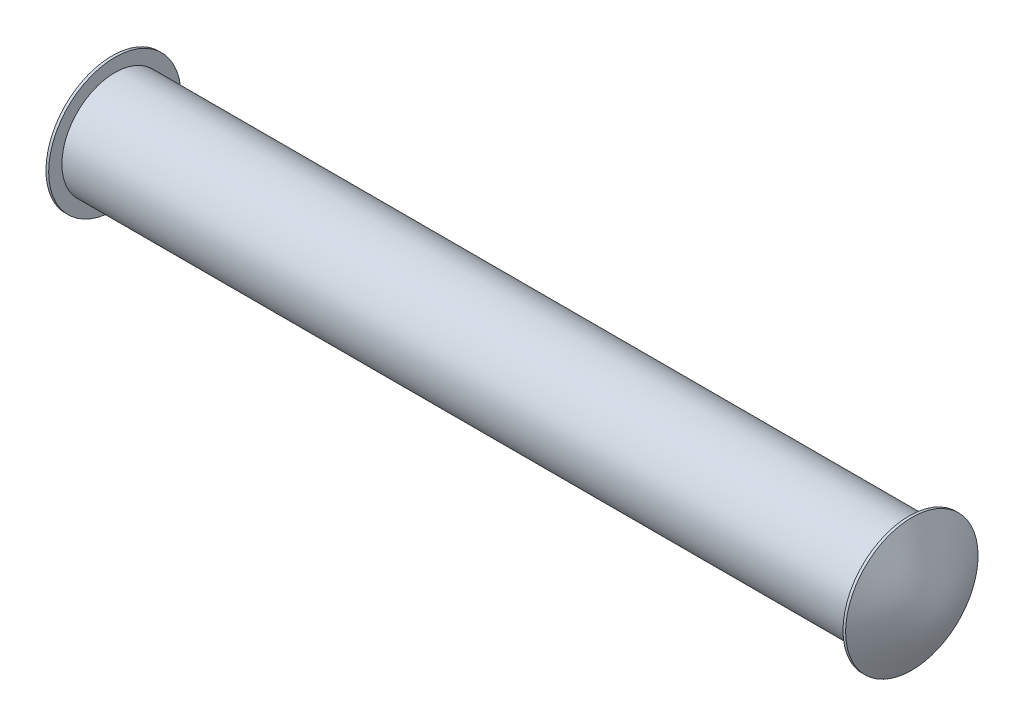
ISO-10303-21;
HEADER;
FILE_DESCRIPTION(('STEP AP214'),'2;1');
FILE_NAME('part.step','',(''),(''),'','','');
FILE_SCHEMA(('AUTOMOTIVE_DESIGN { 1 0 10303 214 1 1 1 1 }'));
ENDSEC;
DATA;
#1=APPLICATION_CONTEXT('core data for automotive mechanical design processes');
#2=APPLICATION_PROTOCOL_DEFINITION('international standard','automotive_design',2000,#1);
#3=PRODUCT_CONTEXT('',#1,'mechanical');
#4=PRODUCT('Part','Part','',(#3));
#5=PRODUCT_RELATED_PRODUCT_CATEGORY('part','',(#4));
#6=PRODUCT_DEFINITION_FORMATION('','',#4);
#7=PRODUCT_DEFINITION_CONTEXT('part definition',#1,'design');
#8=PRODUCT_DEFINITION('design','',#6,#7);
#9=PRODUCT_DEFINITION_SHAPE('','',#8);
#10=(LENGTH_UNIT() NAMED_UNIT(*) SI_UNIT(.MILLI.,.METRE.));
#11=(NAMED_UNIT(*) PLANE_ANGLE_UNIT() SI_UNIT($,.RADIAN.));
#12=(NAMED_UNIT(*) SI_UNIT($,.STERADIAN.) SOLID_ANGLE_UNIT());
#13=UNCERTAINTY_MEASURE_WITH_UNIT(LENGTH_MEASURE(1.E-05),#10,'distance_accuracy_value','');
#14=(GEOMETRIC_REPRESENTATION_CONTEXT(3) GLOBAL_UNCERTAINTY_ASSIGNED_CONTEXT((#13)) GLOBAL_UNIT_ASSIGNED_CONTEXT((#10,
#11,#12)) REPRESENTATION_CONTEXT('',''));
#15=CARTESIAN_POINT('',(0.,0.,0.));
#16=DIRECTION('',(0.,0.,1.));
#17=DIRECTION('',(1.,0.,0.));
#18=AXIS2_PLACEMENT_3D('',#15,#16,#17);
#19=CARTESIAN_POINT('',(3.,0.749999999997947,-0.049999999998232));
#20=DIRECTION('',(-1.,0.,0.));
#21=DIRECTION('',(0.,0.,1.));
#22=AXIS2_PLACEMENT_3D('',#19,#20,#21);
#23=CYLINDRICAL_SURFACE('',#22,0.199999999999999);
#24=CARTESIAN_POINT('',(3.,0.749999999997947,-0.049999999998232));
#25=DIRECTION('',(1.,0.,0.));
#26=DIRECTION('',(0.,0.,-1.));
#27=AXIS2_PLACEMENT_3D('',#24,#25,#26);
#28=CIRCLE('',#27,0.199999999999999);
#29=CARTESIAN_POINT('',(3.,0.749999999997947,-0.249999999998231));
#30=VERTEX_POINT('',#29);
#31=EDGE_CURVE('E12',#30,#30,#28,.T.);
#32=ORIENTED_EDGE('',*,*,#31,.F.);
#33=EDGE_LOOP('',(#32));
#34=FACE_BOUND('',#33,.T.);
#35=CARTESIAN_POINT('',(0.,0.749999999997947,-0.049999999998232));
#36=DIRECTION('',(-1.,0.,0.));
#37=DIRECTION('',(0.,0.,1.));
#38=AXIS2_PLACEMENT_3D('',#35,#36,#37);
#39=CIRCLE('',#38,0.199999999999999);
#40=CARTESIAN_POINT('',(0.,0.749999999997947,0.150000000001767));
#41=VERTEX_POINT('',#40);
#42=EDGE_CURVE('E140',#41,#41,#39,.T.);
#43=ORIENTED_EDGE('',*,*,#42,.F.);
#44=EDGE_LOOP('',(#43));
#45=FACE_BOUND('',#44,.T.);
#46=ADVANCED_FACE('F89',(#34,#45),#23,.T.);
#47=CARTESIAN_POINT('',(3.,0.749999999997947,-0.049999999998232));
#48=DIRECTION('',(1.,0.,0.));
#49=DIRECTION('',(0.,0.,-1.));
#50=AXIS2_PLACEMENT_3D('',#47,#48,#49);
#51=PLANE('',#50);
#52=CARTESIAN_POINT('',(3.,0.749999999997947,-0.049999999998232));
#53=DIRECTION('',(1.,0.,0.));
#54=DIRECTION('',(0.,0.,-1.));
#55=AXIS2_PLACEMENT_3D('',#52,#53,#54);
#56=CIRCLE('',#55,0.25);
#57=CARTESIAN_POINT('',(3.,0.749999999997947,-0.299999999998232));
#58=VERTEX_POINT('',#57);
#59=EDGE_CURVE('E108',#58,#58,#56,.T.);
#60=ORIENTED_EDGE('',*,*,#59,.F.);
#61=EDGE_LOOP('',(#60));
#62=FACE_BOUND('',#61,.T.);
#63=ORIENTED_EDGE('',*,*,#31,.T.);
#64=EDGE_LOOP('',(#63));
#65=FACE_BOUND('',#64,.T.);
#66=ADVANCED_FACE('F131',(#62,#65),#51,.F.);
#67=CARTESIAN_POINT('',(3.01,0.749999999997947,-0.049999999998232));
#68=DIRECTION('',(-1.,0.,0.));
#69=DIRECTION('',(0.,0.,1.));
#70=AXIS2_PLACEMENT_3D('',#67,#68,#69);
#71=CYLINDRICAL_SURFACE('',#70,0.25);
#72=CARTESIAN_POINT('',(3.01010566091061,0.750000000089703,0.200000000001768));
#73=CARTESIAN_POINT('',(3.01010621478674,0.735945178217186,0.200000583232357));
#74=CARTESIAN_POINT('',(3.01010785574932,0.721898030304427,0.198810311442465));
#75=CARTESIAN_POINT('',(3.01010506081938,0.694192800176072,0.194098659631232));
#76=CARTESIAN_POINT('',(3.01010061760915,0.680535206675218,0.190574475139788));
#77=CARTESIAN_POINT('',(3.01011669478687,0.640786354594316,0.17661162218777));
#78=CARTESIAN_POINT('',(3.01016634109076,0.615796343064437,0.16278178524189));
#79=CARTESIAN_POINT('',(3.01018912095916,0.571857923696761,0.127654051914842));
#80=CARTESIAN_POINT('',(3.01016225449396,0.552909518204962,0.106356152633782));
#81=CARTESIAN_POINT('',(3.01013036917123,0.523115933139739,0.0586826787305368));
#82=CARTESIAN_POINT('',(3.01012535011259,0.512270678978309,0.0323071508497935));
#83=CARTESIAN_POINT('',(3.01013460477032,0.49992575674459,-0.0225452144467449));
#84=CARTESIAN_POINT('',(3.01014887848036,0.498426085614128,-0.0510220511749216));
#85=CARTESIAN_POINT('',(3.01013795715021,0.504936409030981,-0.106867397566364));
#86=CARTESIAN_POINT('',(3.01011276183105,0.512946470793762,-0.134235899394426));
#87=CARTESIAN_POINT('',(3.01013515803647,0.537573363746155,-0.184779124882618));
#88=CARTESIAN_POINT('',(3.01018274938338,0.554190173927095,-0.207953858779354));
#89=CARTESIAN_POINT('',(3.01018674201579,0.594161864590235,-0.247494746761235));
#90=CARTESIAN_POINT('',(3.01014314294751,0.617516771213153,-0.263860874431517));
#91=CARTESIAN_POINT('',(3.01010279961868,0.668312901551387,-0.287947791843123));
#92=CARTESIAN_POINT('',(3.01010605523575,0.695754114592634,-0.295668604166912));
#93=CARTESIAN_POINT('',(3.01010688092531,0.751698939198769,-0.301562547747962));
#94=CARTESIAN_POINT('',(3.01010445099375,0.780202551521071,-0.299735672198265));
#95=CARTESIAN_POINT('',(3.01010462975243,0.821207541319959,-0.290064777640974));
#96=CARTESIAN_POINT('',(3.01010533219958,0.834610713918153,-0.285669297769322));
#97=CARTESIAN_POINT('',(3.01012368869417,0.860486341956673,-0.274697015727832));
#98=CARTESIAN_POINT('',(3.01014131908207,0.872960070227693,-0.268123266439211));
#99=CARTESIAN_POINT('',(3.01017014040505,0.896640038892365,-0.252965539734226));
#100=CARTESIAN_POINT('',(3.0101813223447,0.907844491262474,-0.244378777566753));
#101=CARTESIAN_POINT('',(3.01018684661399,0.928638133343687,-0.225458273133616));
#102=CARTESIAN_POINT('',(3.01018121243014,0.938229556145344,-0.215126986407761));
#103=CARTESIAN_POINT('',(3.01015938289471,0.955554967209692,-0.192986222715716));
#104=CARTESIAN_POINT('',(3.01014317287949,0.963286356087469,-0.181174711780633));
#105=CARTESIAN_POINT('',(3.0101203351773,0.976645633257464,-0.156438093320201));
#106=CARTESIAN_POINT('',(3.0101136941453,0.982276442901105,-0.143514563356518));
#107=CARTESIAN_POINT('',(3.01011936956584,0.991296447138331,-0.116887176652151));
#108=CARTESIAN_POINT('',(3.01013171268088,0.994682479465803,-0.103182248509496));
#109=CARTESIAN_POINT('',(3.01014647128551,0.999100899684704,-0.0754178459047155));
#110=CARTESIAN_POINT('',(3.01014890060577,1.00013656566484,-0.0613588929300424));
#111=CARTESIAN_POINT('',(3.01014765964732,0.999834333880446,-0.0332466676979653));
#112=CARTESIAN_POINT('',(3.01014398080947,0.998493105291444,-0.0191934310592368));
#113=CARTESIAN_POINT('',(3.01012860238559,0.993472298346033,0.00846852270833477));
#114=CARTESIAN_POINT('',(3.01011691400126,0.989795986232382,0.0220778328768421));
#115=CARTESIAN_POINT('',(3.01011459278555,0.980205477975831,0.0485053550565719));
#116=CARTESIAN_POINT('',(3.0101239893917,0.974288162672698,0.0613224353395335));
#117=CARTESIAN_POINT('',(3.0101490628406,0.960394158740089,0.0857631364948513));
#118=CARTESIAN_POINT('',(3.01016473090579,0.952420353906863,0.0973883969969048));
#119=CARTESIAN_POINT('',(3.01018388990754,0.934622875714896,0.119151551092098));
#120=CARTESIAN_POINT('',(3.01018736393647,0.924796653752135,0.129287360859389));
#121=CARTESIAN_POINT('',(3.01017784848213,0.903596146235491,0.147751323075117));
#122=CARTESIAN_POINT('',(3.01016488169344,0.892224013956491,0.156081948792798));
#123=CARTESIAN_POINT('',(3.01013513073978,0.868226518076784,0.170726580193291));
#124=CARTESIAN_POINT('',(3.01011834169732,0.855599564931736,0.177037984226776));
#125=CARTESIAN_POINT('',(3.01010317572358,0.829485517175568,0.187443998194885));
#126=CARTESIAN_POINT('',(3.0101047766739,0.815999475244773,0.191541264949165));
#127=CARTESIAN_POINT('',(3.0101059720278,0.785100679180971,0.198142948486242));
#128=CARTESIAN_POINT('',(3.01010496951781,0.76754436083669,0.199999271966368));
#129=CARTESIAN_POINT('',(3.01010566091061,0.750000000089703,0.200000000001768));
#130=B_SPLINE_CURVE_WITH_KNOTS('',3,(#72,#73,#74,#75,#76,#77,#78,#79,#80,#81,#82,#83,#84,#85,
#86,#87,#88,#89,#90,#91,#92,#93,#94,#95,#96,#97,#98,#99,#100,#101,#102,#103,#104,#105,#106,#107,
#108,#109,#110,#111,#112,#113,#114,#115,#116,#117,#118,#119,#120,#121,#122,#123,#124,#125,#126,
#127,#128,#129),.UNSPECIFIED.,.T.,.F.,(4,2,2,2,2,2,2,2,2,2,2,2,2,2,2,2,2,2,2,2,2,2,2,2,2,2,2,2,
4),(0.,0.0420957085666916,0.0842420920717383,0.168184740365065,0.252127421253866,
0.336069329456333,0.420011210190322,0.503953684235001,0.587895953380974,0.67183854818875,
0.755780923729216,0.839723359115822,0.881873931314669,0.923965676892427,0.966115998358525,
1.00820747746237,1.05035744181327,1.0924485661975,1.13459885996592,1.17669032990806,
1.21884083073079,1.26093250218405,1.30308297590961,1.34517466078607,1.38732468482736,
1.42941658908996,1.47156250992368,1.5136577454811,1.56620499963295),.UNSPECIFIED.);
#131=CARTESIAN_POINT('',(3.01010566091061,0.750000000089703,0.200000000001768));
#132=VERTEX_POINT('',#131);
#133=EDGE_CURVE('E103',#132,#132,#130,.T.);
#134=ORIENTED_EDGE('',*,*,#133,.F.);
#135=EDGE_LOOP('',(#134));
#136=FACE_BOUND('',#135,.T.);
#137=ORIENTED_EDGE('',*,*,#59,.T.);
#138=EDGE_LOOP('',(#137));
#139=FACE_BOUND('',#138,.T.);
#140=ADVANCED_FACE('F114',(#136,#139),#71,.T.);
#141=CARTESIAN_POINT('',(2.9503878004014,0.495093674660569,-0.316611208585007));
#142=CARTESIAN_POINT('',(2.96478519255763,0.495093674660569,-0.273953518913214));
#143=CARTESIAN_POINT('',(2.97787732809831,0.495093674660569,-0.231295829241422));
#144=CARTESIAN_POINT('',(2.99005571921114,0.495093674660569,-0.188638139569629));
#145=CARTESIAN_POINT('',(3.00411291594906,0.495093674660569,-0.12465151844212));
#146=CARTESIAN_POINT('',(3.00801787320673,0.495093674660569,-0.0606648973146105));
#147=CARTESIAN_POINT('',(3.00801790185835,0.495093674660569,-0.0393359658588937));
#148=CARTESIAN_POINT('',(3.00411307757205,0.495093674660569,0.0246508285082565));
#149=CARTESIAN_POINT('',(2.9900558082604,0.495093674660569,0.0886376228754068));
#150=CARTESIAN_POINT('',(2.97787721504711,0.495093674660569,0.13129548578684));
#151=CARTESIAN_POINT('',(2.96478503194713,0.495093674660569,0.173953348698274));
#152=CARTESIAN_POINT('',(2.95038765573647,0.495093674660569,0.216611211609707));
#153=CARTESIAN_POINT('',(2.96315484878732,0.535878587953932,-0.316611208585007));
#154=CARTESIAN_POINT('',(2.97983229757104,0.535878587953932,-0.273953518913214));
#155=CARTESIAN_POINT('',(2.99518621370561,0.535878587953932,-0.231295829241422));
#156=CARTESIAN_POINT('',(3.00971593341776,0.535878587953932,-0.188638139569629));
#157=CARTESIAN_POINT('',(3.02654857002032,0.535878587953932,-0.12465151844212));
#158=CARTESIAN_POINT('',(3.03122245260063,0.535878587953932,-0.0606648973146105));
#159=CARTESIAN_POINT('',(3.03122248069263,0.535878587953932,-0.0393359658588937));
#160=CARTESIAN_POINT('',(3.02654873512886,0.535878587953932,0.0246508285082565));
#161=CARTESIAN_POINT('',(3.00971604629732,0.535878587953932,0.0886376228754068));
#162=CARTESIAN_POINT('',(2.99518616479206,0.535878587953932,0.13129548578684));
#163=CARTESIAN_POINT('',(2.97983224940109,0.535878587953932,0.173953348698274));
#164=CARTESIAN_POINT('',(2.96315485194004,0.535878587953932,0.216611211609707));
#165=CARTESIAN_POINT('',(2.97472661101787,0.576663501247295,-0.316611208585007));
#166=CARTESIAN_POINT('',(2.99366786419773,0.576663501247295,-0.273953518913214));
#167=CARTESIAN_POINT('',(3.01124757612683,0.576663501247295,-0.231295829241422));
#168=CARTESIAN_POINT('',(3.02821874507743,0.576663501247295,-0.188638139569629));
#169=CARTESIAN_POINT('',(3.0479251806467,0.576663501247295,-0.12465151844212));
#170=CARTESIAN_POINT('',(3.05339366523572,0.576663501247295,-0.0606648973146105));
#171=CARTESIAN_POINT('',(3.05339369596168,0.576663501247295,-0.0393359658588937));
#172=CARTESIAN_POINT('',(3.04792535232646,0.576663501247295,0.0246508285082565));
#173=CARTESIAN_POINT('',(3.02821890486759,0.576663501247295,0.0886376228754068));
#174=CARTESIAN_POINT('',(3.01124760082065,0.576663501247295,0.13129548578684));
#175=CARTESIAN_POINT('',(2.99366793540668,0.576663501247295,0.173953348698274));
#176=CARTESIAN_POINT('',(2.97472678908443,0.576663501247295,0.216611211609707));
#177=CARTESIAN_POINT('',(2.98543717012414,0.617448414540659,-0.316611208585007));
#178=CARTESIAN_POINT('',(3.00673996827412,0.617448414540659,-0.273953518913214));
#179=CARTESIAN_POINT('',(3.02675578210582,0.617448414540659,-0.231295829241422));
#180=CARTESIAN_POINT('',(3.04648675892173,0.617448414540659,-0.188638139569629));
#181=CARTESIAN_POINT('',(3.06909991503299,0.617448414540659,-0.12465151844212));
#182=CARTESIAN_POINT('',(3.07544956999831,0.617448414540659,-0.0606648973146105));
#183=CARTESIAN_POINT('',(3.07544960377795,0.617448414540659,-0.0393359658588937));
#184=CARTESIAN_POINT('',(3.06910012638308,0.617448414540659,0.0246508285082565));
#185=CARTESIAN_POINT('',(3.04648698745537,0.617448414540659,0.0886376228754068));
#186=CARTESIAN_POINT('',(3.02675605461089,0.617448414540659,0.13129548578684));
#187=CARTESIAN_POINT('',(3.00674036539012,0.617448414540659,0.173953348698274));
#188=CARTESIAN_POINT('',(2.98543761525699,0.617448414540659,0.216611211609707));
#189=CARTESIAN_POINT('',(2.99769307833135,0.678625866726825,-0.316611208585007));
#190=CARTESIAN_POINT('',(3.02182492224242,0.678625866726825,-0.273953518913214));
#191=CARTESIAN_POINT('',(3.04478508313255,0.678625866726825,-0.231295829241422));
#192=CARTESIAN_POINT('',(3.06746923048572,0.678625866726825,-0.188638139569629));
#193=CARTESIAN_POINT('',(3.09547924580182,0.678625866726825,-0.12465151844212));
#194=CARTESIAN_POINT('',(3.10348702454894,0.678625866726825,-0.0606648973146105));
#195=CARTESIAN_POINT('',(3.10348706831505,0.678625866726825,-0.0393359658588937));
#196=CARTESIAN_POINT('',(3.09547951854053,0.678625866726825,0.0246508285082565));
#197=CARTESIAN_POINT('',(3.0674695560946,0.678625866726825,0.0886376228754068));
#198=CARTESIAN_POINT('',(3.04478538556563,0.678625866726825,0.13129548578684));
#199=CARTESIAN_POINT('',(3.02182510567527,0.678625866726825,0.173953348698274));
#200=CARTESIAN_POINT('',(2.99769315628263,0.678625866726825,0.216611211609707));
#201=CARTESIAN_POINT('',(3.00106932813699,0.739803318912992,-0.316611208585007));
#202=CARTESIAN_POINT('',(3.02599585792175,0.739803318912992,-0.273953518913214));
#203=CARTESIAN_POINT('',(3.04978951187148,0.739803318912992,-0.231295829241422));
#204=CARTESIAN_POINT('',(3.07337313196677,0.739803318912992,-0.188638139569629));
#205=CARTESIAN_POINT('',(3.10304681034421,0.739803318912992,-0.12465151844212));
#206=CARTESIAN_POINT('',(3.112266261174,0.739803318912992,-0.0606648973146105));
#207=CARTESIAN_POINT('',(3.11226631503549,0.739803318912992,-0.0393359658588937));
#208=CARTESIAN_POINT('',(3.10304710461681,0.739803318912992,0.0246508285082565));
#209=CARTESIAN_POINT('',(3.0733734294141,0.739803318912992,0.0886376228754068));
#210=CARTESIAN_POINT('',(3.04978972286767,0.739803318912992,0.13129548578684));
#211=CARTESIAN_POINT('',(3.02599594146898,0.739803318912992,0.173953348698274));
#212=CARTESIAN_POINT('',(3.00106930267721,0.739803318912992,0.216611211609707));
#213=CARTESIAN_POINT('',(3.00106929613553,0.760195857805795,-0.316611208585007));
#214=CARTESIAN_POINT('',(3.0259958479661,0.760195857805795,-0.273953518913214));
#215=CARTESIAN_POINT('',(3.04978956417389,0.760195857805795,-0.231295829241422));
#216=CARTESIAN_POINT('',(3.07337316780753,0.760195857805795,-0.188638139569629));
#217=CARTESIAN_POINT('',(3.10304685283147,0.760195857805795,-0.12465151844212));
#218=CARTESIAN_POINT('',(3.11226631235189,0.760195857805795,-0.0606648973146105));
#219=CARTESIAN_POINT('',(3.11226636625746,0.760195857805795,-0.0393359658588937));
#220=CARTESIAN_POINT('',(3.10304714390681,0.760195857805795,0.0246508285082565));
#221=CARTESIAN_POINT('',(3.07337345182608,0.760195857805795,0.0886376228754068));
#222=CARTESIAN_POINT('',(3.04978973309089,0.760195857805795,0.13129548578684));
#223=CARTESIAN_POINT('',(3.0259959592993,0.760195857805795,0.173953348698274));
#224=CARTESIAN_POINT('',(3.00106931504512,0.760195857805795,0.216611211609707));
#225=CARTESIAN_POINT('',(2.99769319257622,0.821373474484205,-0.316611208585007));
#226=CARTESIAN_POINT('',(3.02182511024694,0.821373474484205,-0.273953518913214));
#227=CARTESIAN_POINT('',(3.04478535499775,0.821373474484205,-0.231295829241422));
#228=CARTESIAN_POINT('',(3.06746946911638,0.821373474484205,-0.188638139569629));
#229=CARTESIAN_POINT('',(3.09547950114401,0.821373474484205,-0.12465151844212));
#230=CARTESIAN_POINT('',(3.10348730364901,0.821373474484205,-0.0606648973146105));
#231=CARTESIAN_POINT('',(3.10348734468676,0.821373474484205,-0.0393359658588937));
#232=CARTESIAN_POINT('',(3.09547977092929,0.821373474484205,0.0246508285082565));
#233=CARTESIAN_POINT('',(3.0674697065971,0.821373474484205,0.0886376228754068));
#234=CARTESIAN_POINT('',(3.04478541756994,0.821373474484205,0.13129548578684));
#235=CARTESIAN_POINT('',(3.02182511922908,0.821373474484205,0.173953348698274));
#236=CARTESIAN_POINT('',(2.99769311387466,0.821373474484205,0.216611211609707));
#237=CARTESIAN_POINT('',(2.98543774018658,0.882551091162615,-0.316611208585007));
#238=CARTESIAN_POINT('',(3.00674044840595,0.882551091162615,-0.273953518913214));
#239=CARTESIAN_POINT('',(3.02675609477143,0.882551091162615,-0.231295829241422));
#240=CARTESIAN_POINT('',(3.04648696671887,0.882551091162615,-0.188638139569629));
#241=CARTESIAN_POINT('',(3.06910018078134,0.882551091162615,-0.12465151844212));
#242=CARTESIAN_POINT('',(3.07544984168703,0.882551091162615,-0.0606648973146105));
#243=CARTESIAN_POINT('',(3.07544987831917,0.882551091162615,-0.0393359658588937));
#244=CARTESIAN_POINT('',(3.06910039100854,0.882551091162615,0.0246508285082565));
#245=CARTESIAN_POINT('',(3.04648722716119,0.882551091162615,0.0886376228754067));
#246=CARTESIAN_POINT('',(3.02675614382329,0.882551091162615,0.13129548578684));
#247=CARTESIAN_POINT('',(3.00674022294455,0.882551091162615,0.173953348698274));
#248=CARTESIAN_POINT('',(2.98543729872944,0.882551091162615,0.216611211609707));
#249=CARTESIAN_POINT('',(2.97472688339662,0.923336168948221,-0.316611208585007));
#250=CARTESIAN_POINT('',(2.99366797794918,0.923336168948221,-0.273953518913214));
#251=CARTESIAN_POINT('',(3.01124759610734,0.923336168948221,-0.231295829241422));
#252=CARTESIAN_POINT('',(3.02821884671139,0.923336168948221,-0.188638139569629));
#253=CARTESIAN_POINT('',(3.0479253378766,0.923336168948221,-0.12465151844212));
#254=CARTESIAN_POINT('',(3.05339384619102,0.923336168948221,-0.0606648973146105));
#255=CARTESIAN_POINT('',(3.05339387364024,0.923336168948221,-0.0393359658588937));
#256=CARTESIAN_POINT('',(3.04792553637146,0.923336168948221,0.0246508285082565));
#257=CARTESIAN_POINT('',(3.02821910481061,0.923336168948221,0.0886376228754068));
#258=CARTESIAN_POINT('',(3.01124785100872,0.923336168948221,0.13129548578684));
#259=CARTESIAN_POINT('',(2.993668057516,0.923336168948221,0.173953348698274));
#260=CARTESIAN_POINT('',(2.97472670729226,0.923336168948221,0.216611211609707));
#261=CARTESIAN_POINT('',(2.96315491348892,0.964121246733828,-0.316611208585007));
#262=CARTESIAN_POINT('',(2.97983225519395,0.964121246733828,-0.273953518913214));
#263=CARTESIAN_POINT('',(2.99518611974313,0.964121246733828,-0.231295829241422));
#264=CARTESIAN_POINT('',(3.00971594551552,0.964121246733828,-0.188638139569629));
#265=CARTESIAN_POINT('',(3.02654866796346,0.964121246733828,-0.12465151844212));
#266=CARTESIAN_POINT('',(3.03122254903032,0.964121246733828,-0.0606648973146105));
#267=CARTESIAN_POINT('',(3.03122257181967,0.964121246733828,-0.0393359658588937));
#268=CARTESIAN_POINT('',(3.02654881781863,0.964121246733828,0.0246508285082565));
#269=CARTESIAN_POINT('',(3.00971619108,0.964121246733828,0.0886376228754068));
#270=CARTESIAN_POINT('',(2.9951864099144,0.964121246733828,0.13129548578684));
#271=CARTESIAN_POINT('',(2.97983243397129,0.964121246733828,0.173953348698274));
#272=CARTESIAN_POINT('',(2.96315491034421,0.964121246733828,0.216611211609707));
#273=CARTESIAN_POINT('',(2.95038767170209,1.00490632451943,-0.316611208585007));
#274=CARTESIAN_POINT('',(2.96478498813803,1.00490632451943,-0.273953518913214));
#275=CARTESIAN_POINT('',(2.97787711678445,1.00490632451943,-0.231295829241422));
#276=CARTESIAN_POINT('',(2.99005565587774,1.00490632451943,-0.188638139569629));
#277=CARTESIAN_POINT('',(3.00411294417555,1.00490632451943,-0.12465151844212));
#278=CARTESIAN_POINT('',(3.00801788014052,1.00490632451943,-0.0606648973146105));
#279=CARTESIAN_POINT('',(3.00801789405711,1.00490632451943,-0.0393359658588937));
#280=CARTESIAN_POINT('',(3.00411304650822,1.00490632451943,0.0246508285082565));
#281=CARTESIAN_POINT('',(2.99005586658508,1.00490632451943,0.0886376228754068));
#282=CARTESIAN_POINT('',(2.97787743379691,1.00490632451943,0.13129548578684));
#283=CARTESIAN_POINT('',(2.96478525888471,1.00490632451943,0.173953348698274));
#284=CARTESIAN_POINT('',(2.95038781414428,1.00490632451943,0.216611211609707));
#285=B_SPLINE_SURFACE_WITH_KNOTS('',5,5,((#141,#142,#143,#144,#145,#146,#147,#148,#149,#150,
#151,#152),(#153,#154,#155,#156,#157,#158,#159,#160,#161,#162,#163,#164),(#165,#166,#167,#168,
#169,#170,#171,#172,#173,#174,#175,#176),(#177,#178,#179,#180,#181,#182,#183,#184,#185,#186,
#187,#188),(#189,#190,#191,#192,#193,#194,#195,#196,#197,#198,#199,#200),(#201,#202,#203,#204,
#205,#206,#207,#208,#209,#210,#211,#212),(#213,#214,#215,#216,#217,#218,#219,#220,#221,#222,
#223,#224),(#225,#226,#227,#228,#229,#230,#231,#232,#233,#234,#235,#236),(#237,#238,#239,#240,
#241,#242,#243,#244,#245,#246,#247,#248),(#249,#250,#251,#252,#253,#254,#255,#256,#257,#258,
#259,#260),(#261,#262,#263,#264,#265,#266,#267,#268,#269,#270,#271,#272),(#273,#274,#275,#276,
#277,#278,#279,#280,#281,#282,#283,#284)),.UNSPECIFIED.,.F.,.F.,.F.,(6,3,3,6),(6,3,3,6),
(-0.254906326169742,-0.050981759702925,0.0509809347610911,0.254906323689123),
(-0.266611208610582,-0.053322760251619,0.0533218970269647,0.266611211584132),.UNSPECIFIED.);
#286=ORIENTED_EDGE('',*,*,#133,.T.);
#287=EDGE_LOOP('',(#286));
#288=FACE_BOUND('',#287,.T.);
#289=ADVANCED_FACE('F118',(#288),#285,.T.);
#290=CARTESIAN_POINT('',(0.,0.749999999997947,-0.049999999998232));
#291=DIRECTION('',(-1.,0.,0.));
#292=DIRECTION('',(0.,0.,1.));
#293=AXIS2_PLACEMENT_3D('',#290,#291,#292);
#294=PLANE('',#293);
#295=CARTESIAN_POINT('',(0.,0.749999999997947,-0.049999999998232));
#296=DIRECTION('',(-1.,0.,0.));
#297=DIRECTION('',(0.,0.,1.));
#298=AXIS2_PLACEMENT_3D('',#295,#296,#297);
#299=CIRCLE('',#298,0.25);
#300=CARTESIAN_POINT('',(0.,0.749999999997947,0.200000000001768));
#301=VERTEX_POINT('',#300);
#302=EDGE_CURVE('E144',#301,#301,#299,.T.);
#303=ORIENTED_EDGE('',*,*,#302,.F.);
#304=EDGE_LOOP('',(#303));
#305=FACE_BOUND('',#304,.T.);
#306=ORIENTED_EDGE('',*,*,#42,.T.);
#307=EDGE_LOOP('',(#306));
#308=FACE_BOUND('',#307,.T.);
#309=ADVANCED_FACE('F123',(#305,#308),#294,.F.);
#310=CARTESIAN_POINT('',(-0.01,0.749999999997947,-0.049999999998232));
#311=DIRECTION('',(1.,0.,0.));
#312=DIRECTION('',(0.,0.,-1.));
#313=AXIS2_PLACEMENT_3D('',#310,#311,#312);
#314=CYLINDRICAL_SURFACE('',#313,0.25);
#315=CARTESIAN_POINT('',(-0.0101056608739972,0.750000000089703,-0.299999999998231));
#316=CARTESIAN_POINT('',(-0.0101062147505974,0.735945178217424,-0.300000583228819));
#317=CARTESIAN_POINT('',(-0.0101078557021101,0.721898030304892,-0.298810311438967));
#318=CARTESIAN_POINT('',(-0.0101050607689872,0.694192800176971,-0.29409865962789));
#319=CARTESIAN_POINT('',(-0.0101006175666605,0.680535206676325,-0.290574475136558));
#320=CARTESIAN_POINT('',(-0.0101166948392986,0.640786354596021,-0.276611622184996));
#321=CARTESIAN_POINT('',(-0.0101663413008803,0.615796343066493,-0.262781785239574));
#322=CARTESIAN_POINT('',(-0.0101891209367594,0.57185792369901,-0.22765405191353));
#323=CARTESIAN_POINT('',(-0.0101622540813454,0.552909518207114,-0.206356152632938));
#324=CARTESIAN_POINT('',(-0.0101303690143837,0.523115933140742,-0.158682678729353));
#325=CARTESIAN_POINT('',(-0.0101253506017241,0.512270678978624,-0.132307150847573));
#326=CARTESIAN_POINT('',(-0.0101346053064422,0.499925756743574,-0.0774547855452983));
#327=CARTESIAN_POINT('',(-0.0101488784175095,0.498426085613648,-0.0489779488121561));
#328=CARTESIAN_POINT('',(-0.0101379568262364,0.504936409034159,0.00686739758365852));
#329=CARTESIAN_POINT('',(-0.0101127618449387,0.512946470798503,0.034235899411309));
#330=CARTESIAN_POINT('',(-0.0101351582623027,0.537573363751952,0.0847791248944325));
#331=CARTESIAN_POINT('',(-0.0101827494832864,0.554190173931115,0.10795385878713));
#332=CARTESIAN_POINT('',(-0.010186741965212,0.594161864590727,0.147494746764995));
#333=CARTESIAN_POINT('',(-0.0101431428723636,0.617516771212606,0.163860874434575));
#334=CARTESIAN_POINT('',(-0.0101027995754991,0.668312901551783,0.187947791847065));
#335=CARTESIAN_POINT('',(-0.0101060552490989,0.695754114595523,0.195668604171356));
#336=CARTESIAN_POINT('',(-0.0101068809992895,0.751698939204882,0.201562547751543));
#337=CARTESIAN_POINT('',(-0.010104451071827,0.780202551527853,0.199735672201055));
#338=CARTESIAN_POINT('',(-0.0101046297833317,0.821207541327085,0.190064777642396));
#339=CARTESIAN_POINT('',(-0.010105332205757,0.834610713925121,0.18566929777036));
#340=CARTESIAN_POINT('',(-0.0101236886283947,0.860486341963299,0.174697015728105));
#341=CARTESIAN_POINT('',(-0.010141318969101,0.872960070234139,0.168123266439105));
#342=CARTESIAN_POINT('',(-0.0101701402750847,0.896640038898396,0.152965539733415));
#343=CARTESIAN_POINT('',(-0.0101813222450288,0.90784449126826,0.144378777565601));
#344=CARTESIAN_POINT('',(-0.0101868466496143,0.928638133348979,0.12545827313176));
#345=CARTESIAN_POINT('',(-0.0101812125706604,0.938229556150391,0.115126986405547));
#346=CARTESIAN_POINT('',(-0.0101593831933236,0.955554967214909,0.0929862227118765));
#347=CARTESIAN_POINT('',(-0.0101431732312195,0.963286356092939,0.0811747117753971));
#348=CARTESIAN_POINT('',(-0.0101203352614947,0.97664563326296,0.0564380933122058));
#349=CARTESIAN_POINT('',(-0.0101136939093687,0.982276442906379,0.0435145633471604));
#350=CARTESIAN_POINT('',(-0.0101193690881586,0.991296447143098,0.0168871766389449));
#351=CARTESIAN_POINT('',(-0.0101317122821476,0.994682479470119,0.00318224849374751));
#352=CARTESIAN_POINT('',(-0.0101464710662919,0.99910089968732,-0.0245821541160149));
#353=CARTESIAN_POINT('',(-0.0101489004871065,1.0001365656662,-0.0386411070931309));
#354=CARTESIAN_POINT('',(-0.0101476597926824,0.999834333878497,-0.0667533323268384));
#355=CARTESIAN_POINT('',(-0.0101439811184162,0.998493105287978,-0.0808065689647598));
#356=CARTESIAN_POINT('',(-0.0101286028322493,0.993472298339851,-0.108468522730431));
#357=CARTESIAN_POINT('',(-0.0101169144223211,0.989795986224985,-0.122077832897843));
#358=CARTESIAN_POINT('',(-0.0101145929073884,0.980205477965453,-0.148505355077482));
#359=CARTESIAN_POINT('',(-0.0101239892395631,0.974288162660214,-0.161322435361326));
#360=CARTESIAN_POINT('',(-0.0101490624894613,0.960394158723191,-0.185763136517676));
#361=CARTESIAN_POINT('',(-0.0101647306291377,0.952420353887659,-0.197388397019883));
#362=CARTESIAN_POINT('',(-0.0101838898054888,0.934622875693174,-0.219151551112086));
#363=CARTESIAN_POINT('',(-0.0101873639345776,0.92479665373067,-0.229287360876617));
#364=CARTESIAN_POINT('',(-0.0101778485974793,0.90359614621521,-0.247751323087176));
#365=CARTESIAN_POINT('',(-0.010164881825991,0.892224013937145,-0.256081948802459));
#366=CARTESIAN_POINT('',(-0.0101351308400233,0.868226518059374,-0.270726580198988));
#367=CARTESIAN_POINT('',(-0.0101183417479707,0.855599564915267,-0.277037984230809));
#368=CARTESIAN_POINT('',(-0.0101031757025884,0.829485517161242,-0.287443998196051));
#369=CARTESIAN_POINT('',(-0.0101047766308437,0.815999475231647,-0.291541264949125));
#370=CARTESIAN_POINT('',(-0.010105971972056,0.785100679172916,-0.298142948483566));
#371=CARTESIAN_POINT('',(-0.0101049694806113,0.767544360832674,-0.299999271962835));
#372=CARTESIAN_POINT('',(-0.0101056608739972,0.750000000089703,-0.299999999998231));
#373=B_SPLINE_CURVE_WITH_KNOTS('',3,(#315,#316,#317,#318,#319,#320,#321,#322,#323,#324,#325,
#326,#327,#328,#329,#330,#331,#332,#333,#334,#335,#336,#337,#338,#339,#340,#341,#342,#343,#344,
#345,#346,#347,#348,#349,#350,#351,#352,#353,#354,#355,#356,#357,#358,#359,#360,#361,#362,#363,
#364,#365,#366,#367,#368,#369,#370,#371,#372),.UNSPECIFIED.,.T.,.F.,(4,2,2,2,2,2,2,2,2,2,2,2,2,
2,2,2,2,2,2,2,2,2,2,2,2,2,2,2,4),(0.,0.0420957085660015,0.0842420920703622,0.168184740362279,
0.252127421250526,0.336069329456211,0.420011210204025,0.503953684248777,0.587895953382439,
0.671838548186802,0.755780923734357,0.839723359123014,0.881873931321783,0.923965676899412,
0.966115998365722,1.0082074774697,1.05035744182441,1.09244856621242,1.13459885998772,
1.17669032993698,1.2188408307575,1.26093250220884,1.30308297593887,1.34517466081975,
1.38732468485472,1.42941658911077,1.47156250993997,1.51365774549292,1.56620499963276),.UNSPECIFIED.);
#374=CARTESIAN_POINT('',(-0.0101056608739972,0.750000000089703,-0.299999999998231));
#375=VERTEX_POINT('',#374);
#376=EDGE_CURVE('E96',#375,#375,#373,.T.);
#377=ORIENTED_EDGE('',*,*,#376,.F.);
#378=EDGE_LOOP('',(#377));
#379=FACE_BOUND('',#378,.T.);
#380=ORIENTED_EDGE('',*,*,#302,.T.);
#381=EDGE_LOOP('',(#380));
#382=FACE_BOUND('',#381,.T.);
#383=ADVANCED_FACE('F149',(#379,#382),#314,.T.);
#384=CARTESIAN_POINT('',(0.0496123426020449,0.495093674660568,-0.31661121160618));
#385=CARTESIAN_POINT('',(0.0352150239389091,0.495093674660568,-0.273953521934518));
#386=CARTESIAN_POINT('',(0.022122888602138,0.495093674660568,-0.231295832262855));
#387=CARTESIAN_POINT('',(0.00994434304113647,0.495093674660568,-0.188638142591193));
#388=CARTESIAN_POINT('',(-0.00411294527446111,0.495093674660568,-0.124651521463709));
#389=CARTESIAN_POINT('',(-0.00801788057439355,0.495093674660568,-0.0606649003362257));
#390=CARTESIAN_POINT('',(-0.00801789449117205,0.495093674660568,-0.0393359688804044));
#391=CARTESIAN_POINT('',(-0.00411304824619351,0.495093674660568,0.0246508254870595));
#392=CARTESIAN_POINT('',(0.00994412948939984,0.495093674660568,0.0886376198545233));
#393=CARTESIAN_POINT('',(0.0221225682526274,0.495093674660568,0.131295482766166));
#394=CARTESIAN_POINT('',(0.0352147515562044,0.495093674660568,0.173953345677808));
#395=CARTESIAN_POINT('',(0.0496122012602665,0.495093674660568,0.216611208589451));
#396=CARTESIAN_POINT('',(0.0368451472410342,0.535878587953931,-0.31661121160618));
#397=CARTESIAN_POINT('',(0.0201678165026619,0.535878587953931,-0.273953521934518));
#398=CARTESIAN_POINT('',(0.00481395733547167,0.535878587953931,-0.231295832262855));
#399=CARTESIAN_POINT('',(-0.00971586541307209,0.535878587953931,-0.188638142591193));
#400=CARTESIAN_POINT('',(-0.0265485769572658,0.535878587953931,-0.124651521463709));
#401=CARTESIAN_POINT('',(-0.03122245516981,0.535878587953931,-0.0606649003362257));
#402=CARTESIAN_POINT('',(-0.0312224781236266,0.535878587953931,-0.0393359688804044));
#403=CARTESIAN_POINT('',(-0.0265487281914629,0.535878587953931,0.0246508254870595));
#404=CARTESIAN_POINT('',(-0.00971611430041051,0.535878587953931,0.0886376198545233));
#405=CARTESIAN_POINT('',(0.00481366416660169,0.535878587953931,0.131295482766166));
#406=CARTESIAN_POINT('',(0.020167636524971,0.535878587953931,0.173953345677808));
#407=CARTESIAN_POINT('',(0.0368451520318449,0.535878587953931,0.216611208589451));
#408=CARTESIAN_POINT('',(0.0252732109301962,0.576663501247295,-0.31661121160618));
#409=CARTESIAN_POINT('',(0.00633214031165184,0.576663501247295,-0.273953521934518));
#410=CARTESIAN_POINT('',(-0.0112474595647389,0.576663501247295,-0.231295832262855));
#411=CARTESIAN_POINT('',(-0.0282186942181944,0.576663501247295,-0.188638142591193));
#412=CARTESIAN_POINT('',(-0.0479251661396976,0.576663501247295,-0.124651521463709));
#413=CARTESIAN_POINT('',(-0.053393666736022,0.576663501247295,-0.0606649003362257));
#414=CARTESIAN_POINT('',(-0.0533936944613576,0.576663501247295,-0.0393359688804044));
#415=CARTESIAN_POINT('',(-0.0479253668330249,0.576663501247295,0.0246508254870595));
#416=CARTESIAN_POINT('',(-0.0282189557259018,0.576663501247295,0.0886376198545233));
#417=CARTESIAN_POINT('',(-0.0112477173831544,0.576663501247295,0.131295482766166));
#418=CARTESIAN_POINT('',(0.00633206008344489,0.576663501247295,0.173953345677808));
#419=CARTESIAN_POINT('',(0.0252733889677597,0.576663501247295,0.216611208589451));
#420=CARTESIAN_POINT('',(0.0145623854309901,0.617448414540658,-0.31661121160618));
#421=CARTESIAN_POINT('',(-0.00674027933457508,0.617448414540658,-0.273953521934518));
#422=CARTESIAN_POINT('',(-0.0267558931031074,0.617448414540658,-0.231295832262855));
#423=CARTESIAN_POINT('',(-0.0464867413591009,0.617448414540658,-0.188638142591193));
#424=CARTESIAN_POINT('',(-0.0690999144640003,0.617448414540658,-0.124651521463709));
#425=CARTESIAN_POINT('',(-0.0754495683911051,0.617448414540658,-0.0606649003362257));
#426=CARTESIAN_POINT('',(-0.0754496053851306,0.617448414540658,-0.0393359688804044));
#427=CARTESIAN_POINT('',(-0.0691001269519306,0.617448414540658,0.0246508254870595));
#428=CARTESIAN_POINT('',(-0.046487005018352,0.617448414540658,0.0886376198545233));
#429=CARTESIAN_POINT('',(-0.0267559436153437,0.617448414540658,0.131295482766166));
#430=CARTESIAN_POINT('',(-0.00674005432993487,0.617448414540658,0.173953345677808));
#431=CARTESIAN_POINT('',(0.0145628291881484,0.617448414540658,0.216611208589451));
#432=CARTESIAN_POINT('',(0.00230684424817853,0.678625866726825,-0.31661121160618));
#433=CARTESIAN_POINT('',(-0.0218250081044747,0.678625866726825,-0.273953521934518));
#434=CARTESIAN_POINT('',(-0.0447852007273283,0.678625866726825,-0.231295832262855));
#435=CARTESIAN_POINT('',(-0.0674692725482257,0.678625866726825,-0.188638142591193));
#436=CARTESIAN_POINT('',(-0.0954792458246862,0.678625866726825,-0.124651521463709));
#437=CARTESIAN_POINT('',(-0.103487025707724,0.678625866726825,-0.0606649003362257));
#438=CARTESIAN_POINT('',(-0.103487067156347,0.678625866726825,-0.0393359688804044));
#439=CARTESIAN_POINT('',(-0.0954795185177823,0.678625866726825,0.0246508254870595));
#440=CARTESIAN_POINT('',(-0.0674695140326132,0.678625866726825,0.0886376198545233));
#441=CARTESIAN_POINT('',(-0.0447852679702377,0.678625866726825,0.131295482766166));
#442=CARTESIAN_POINT('',(-0.0218250198128708,0.678625866726825,0.173953345677808));
#443=CARTESIAN_POINT('',(0.00230692113818526,0.678625866726825,0.216611208589451));
#444=CARTESIAN_POINT('',(-0.00106930236650094,0.739803318912992,-0.31661121160618));
#445=CARTESIAN_POINT('',(-0.0259958408563113,0.739803318912992,-0.273953521934518));
#446=CARTESIAN_POINT('',(-0.0497895305325485,0.739803318912992,-0.231295832262855));
#447=CARTESIAN_POINT('',(-0.0733731363238754,0.739803318912992,-0.188638142591193));
#448=CARTESIAN_POINT('',(-0.103046810388711,0.739803318912992,-0.124651521463709));
#449=CARTESIAN_POINT('',(-0.112266260894897,0.739803318912992,-0.0606649003362257));
#450=CARTESIAN_POINT('',(-0.112266315314624,0.739803318912992,-0.0393359688804044));
#451=CARTESIAN_POINT('',(-0.103047104572234,0.739803318912992,0.0246508254870595));
#452=CARTESIAN_POINT('',(-0.0733734250568166,0.739803318912992,0.0886376198545233));
#453=CARTESIAN_POINT('',(-0.0497897042059257,0.739803318912992,0.131295482766166));
#454=CARTESIAN_POINT('',(-0.0259959585339334,0.739803318912992,0.173953345677808));
#455=CARTESIAN_POINT('',(-0.0010693284471984,0.739803318912992,0.216611208589451));
#456=CARTESIAN_POINT('',(-0.00106931473438863,0.760195857805795,-0.31661121160618));
#457=CARTESIAN_POINT('',(-0.0259958586865772,0.760195857805795,-0.273953521934518));
#458=CARTESIAN_POINT('',(-0.049789540755871,0.760195857805795,-0.231295832262855));
#459=CARTESIAN_POINT('',(-0.0733731587356572,0.760195857805795,-0.188638142591193));
#460=CARTESIAN_POINT('',(-0.103046849678572,0.760195857805795,-0.124651521463709));
#461=CARTESIAN_POINT('',(-0.112266312116698,0.760195857805795,-0.0606649003362257));
#462=CARTESIAN_POINT('',(-0.112266366492639,0.760195857805795,-0.0393359688804044));
#463=CARTESIAN_POINT('',(-0.103047147059566,0.760195857805795,0.0246508254870595));
#464=CARTESIAN_POINT('',(-0.0733734608974868,0.760195857805795,0.0886376198545233));
#465=CARTESIAN_POINT('',(-0.0497897565087592,0.760195857805795,0.131295482766166));
#466=CARTESIAN_POINT('',(-0.0259959485783482,0.760195857805795,0.173953345677808));
#467=CARTESIAN_POINT('',(-0.0010692964456951,0.760195857805795,0.216611208589451));
#468=CARTESIAN_POINT('',(0.0023068866562922,0.821373474484205,-0.31661121160618));
#469=CARTESIAN_POINT('',(-0.021825021657943,0.821373474484205,-0.273953521934518));
#470=CARTESIAN_POINT('',(-0.0447852327313447,0.821373474484205,-0.231295832262855));
#471=CARTESIAN_POINT('',(-0.0674694230494909,0.821373474484205,-0.188638142591193));
#472=CARTESIAN_POINT('',(-0.0954794982124514,0.821373474484205,-0.124651521463709));
#473=CARTESIAN_POINT('',(-0.10348730207926,0.821373474484205,-0.0606649003362257));
#474=CARTESIAN_POINT('',(-0.103487346256413,0.821373474484205,-0.0393359688804044));
#475=CARTESIAN_POINT('',(-0.0954797738605219,0.821373474484205,0.0246508254870595));
#476=CARTESIAN_POINT('',(-0.0674697526628288,0.821373474484205,0.0886376198545233));
#477=CARTESIAN_POINT('',(-0.0447855398361782,0.821373474484205,0.131295482766166));
#478=CARTESIAN_POINT('',(-0.021825207817496,0.821373474484205,0.173953345677808));
#479=CARTESIAN_POINT('',(0.00230680689351913,0.821373474484205,0.216611208589451));
#480=CARTESIAN_POINT('',(0.0145627019587335,0.882551091162614,-0.31661121160618));
#481=CARTESIAN_POINT('',(-0.00674013688813118,0.882551091162614,-0.273953521934518));
#482=CARTESIAN_POINT('',(-0.0267559823132574,0.882551091162614,-0.231295832262855));
#483=CARTESIAN_POINT('',(-0.0464869810638297,0.882551091162614,-0.188638142591193));
#484=CARTESIAN_POINT('',(-0.0691001790891814,0.882551091162614,-0.124651521463709));
#485=CARTESIAN_POINT('',(-0.075449842932247,0.882551091162614,-0.0606649003362257));
#486=CARTESIAN_POINT('',(-0.0754498770739111,0.882551091162614,-0.0393359688804044));
#487=CARTESIAN_POINT('',(-0.0691003927006,0.882551091162614,0.0246508254870595));
#488=CARTESIAN_POINT('',(-0.0464872128153014,0.882551091162614,0.0886376198545233));
#489=CARTESIAN_POINT('',(-0.0267562562790185,0.882551091162614,0.131295482766166));
#490=CARTESIAN_POINT('',(-0.00674053446130185,0.882551091162614,0.173953345677808));
#491=CARTESIAN_POINT('',(0.0145622591258805,0.882551091162614,0.216611208589451));
#492=CARTESIAN_POINT('',(0.0252732927224955,0.923336168948221,-0.31661121160618));
#493=CARTESIAN_POINT('',(0.00633201820324396,0.923336168948221,-0.273953521934518));
#494=CARTESIAN_POINT('',(-0.0112477097518983,0.923336168948221,-0.231295832262855));
#495=CARTESIAN_POINT('',(-0.0282188941617209,0.923336168948221,-0.188638142591193));
#496=CARTESIAN_POINT('',(-0.0479253501847768,0.923336168948221,-0.124651521463709));
#497=CARTESIAN_POINT('',(-0.0533938444145399,0.923336168948221,-0.0606649003362257));
#498=CARTESIAN_POINT('',(-0.0533938754166564,0.923336168948221,-0.0393359688804044));
#499=CARTESIAN_POINT('',(-0.0479255240634918,0.923336168948221,0.0246508254870595));
#500=CARTESIAN_POINT('',(-0.0282190573606774,0.923336168948221,0.0886376198545233));
#501=CARTESIAN_POINT('',(-0.0112477373631397,0.923336168948221,0.131295482766166));
#502=CARTESIAN_POINT('',(0.00633194633277272,0.923336168948221,0.173953345677808));
#503=CARTESIAN_POINT('',(0.0252731165891328,0.923336168948221,0.216611208589451));
#504=CARTESIAN_POINT('',(0.0368450888369399,0.964121246733827,-0.31661121160618));
#505=CARTESIAN_POINT('',(0.0201676319330193,0.964121246733827,-0.273953521934518));
#506=CARTESIAN_POINT('',(0.00481371221364368,0.964121246733827,-0.231295832262855));
#507=CARTESIAN_POINT('',(-0.00971601019705402,0.964121246733827,-0.188638142591193));
#508=CARTESIAN_POINT('',(-0.0265486596473003,0.964121246733827,-0.124651521463709));
#509=CARTESIAN_POINT('',(-0.0312225462966269,0.964121246733827,-0.0606649003362257));
#510=CARTESIAN_POINT('',(-0.0312225745531384,0.964121246733827,-0.0393359688804044));
#511=CARTESIAN_POINT('',(-0.0265488261350633,0.964121246733827,0.0246508254870595));
#512=CARTESIAN_POINT('',(-0.00971612639963599,0.964121246733827,0.0886376198545233));
#513=CARTESIAN_POINT('',(0.00481375812958522,0.964121246733827,0.131295482766166));
#514=CARTESIAN_POINT('',(0.0201676789025488,0.964121246733827,0.173953345677808));
#515=CARTESIAN_POINT('',(0.0368450873303263,0.964121246733827,0.216611208589451));
#516=CARTESIAN_POINT('',(0.0496121841942726,1.00490632451943,-0.31661121160618));
#517=CARTESIAN_POINT('',(0.0352147970016271,1.00490632451943,-0.273953521934518));
#518=CARTESIAN_POINT('',(0.0221226698522506,1.00490632451943,-0.231295832262855));
#519=CARTESIAN_POINT('',(0.00994428471448029,1.00490632451943,-0.188638142591193));
#520=CARTESIAN_POINT('',(-0.00411291421102583,1.00490632451943,-0.124651521463709));
#521=CARTESIAN_POINT('',(-0.00801787277267852,1.00490632451943,-0.0606649003362257));
#522=CARTESIAN_POINT('',(-0.00801790142448948,1.00490632451943,-0.0393359688804044));
#523=CARTESIAN_POINT('',(-0.00411307647311103,1.00490632451943,0.0246508254870595));
#524=CARTESIAN_POINT('',(0.00994419282092626,1.00490632451943,0.0886376198545233));
#525=CARTESIAN_POINT('',(0.0221227795665648,1.00490632451943,0.131295482766166));
#526=CARTESIAN_POINT('',(0.035214955976175,1.00490632451943,0.173953345677808));
#527=CARTESIAN_POINT('',(0.0496123299596425,1.00490632451943,0.216611208589451));
#528=B_SPLINE_SURFACE_WITH_KNOTS('',5,5,((#384,#385,#386,#387,#388,#389,#390,#391,#392,#393,
#394,#395),(#396,#397,#398,#399,#400,#401,#402,#403,#404,#405,#406,#407),(#408,#409,#410,#411,
#412,#413,#414,#415,#416,#417,#418,#419),(#420,#421,#422,#423,#424,#425,#426,#427,#428,#429,
#430,#431),(#432,#433,#434,#435,#436,#437,#438,#439,#440,#441,#442,#443),(#444,#445,#446,#447,
#448,#449,#450,#451,#452,#453,#454,#455),(#456,#457,#458,#459,#460,#461,#462,#463,#464,#465,
#466,#467),(#468,#469,#470,#471,#472,#473,#474,#475,#476,#477,#478,#479),(#480,#481,#482,#483,
#484,#485,#486,#487,#488,#489,#490,#491),(#492,#493,#494,#495,#496,#497,#498,#499,#500,#501,
#502,#503),(#504,#505,#506,#507,#508,#509,#510,#511,#512,#513,#514,#515),(#516,#517,#518,#519,
#520,#521,#522,#523,#524,#525,#526,#527)),.UNSPECIFIED.,.F.,.F.,.F.,(6,3,3,6),(6,3,3,6),
(-0.254906326169742,-0.0509817597029253,0.0509809347610908,0.254906323689123),
(-0.266611211584141,-0.053322763225829,0.0533218940532774,0.26661120861149),.UNSPECIFIED.);
#529=ORIENTED_EDGE('',*,*,#376,.T.);
#530=EDGE_LOOP('',(#529));
#531=FACE_BOUND('',#530,.T.);
#532=ADVANCED_FACE('F91',(#531),#528,.F.);
#533=CLOSED_SHELL('',(#46,#66,#140,#289,#309,#383,#532));
#534=MANIFOLD_SOLID_BREP('B2',#533);
#535=ADVANCED_BREP_SHAPE_REPRESENTATION('',(#18,#534),#14);
#536=SHAPE_DEFINITION_REPRESENTATION(#9,#535);
ENDSEC;
END-ISO-10303-21;
